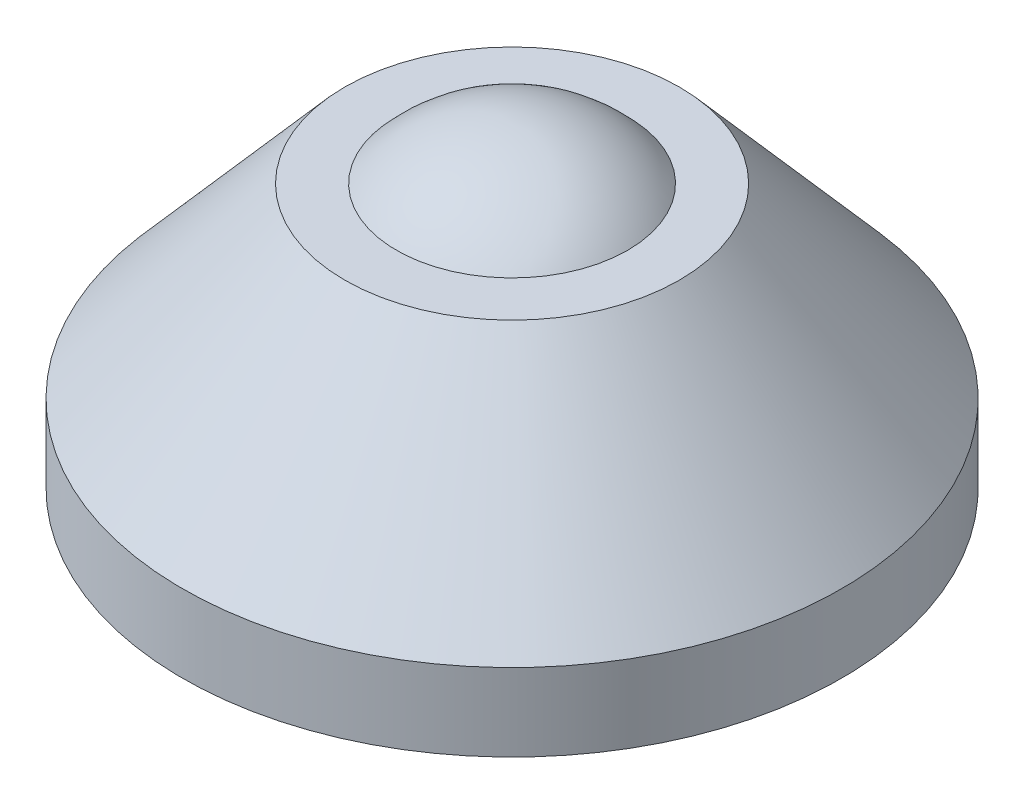
ISO-10303-21;
HEADER;
FILE_DESCRIPTION(('STEP AP214'),'2;1');
FILE_NAME('part.step','',(''),(''),'','','');
FILE_SCHEMA(('AUTOMOTIVE_DESIGN { 1 0 10303 214 1 1 1 1 }'));
ENDSEC;
DATA;
#1=APPLICATION_CONTEXT('core data for automotive mechanical design processes');
#2=APPLICATION_PROTOCOL_DEFINITION('international standard','automotive_design',2000,#1);
#3=PRODUCT_CONTEXT('',#1,'mechanical');
#4=PRODUCT('Part','Part','',(#3));
#5=PRODUCT_RELATED_PRODUCT_CATEGORY('part','',(#4));
#6=PRODUCT_DEFINITION_FORMATION('','',#4);
#7=PRODUCT_DEFINITION_CONTEXT('part definition',#1,'design');
#8=PRODUCT_DEFINITION('design','',#6,#7);
#9=PRODUCT_DEFINITION_SHAPE('','',#8);
#10=(LENGTH_UNIT() NAMED_UNIT(*) SI_UNIT(.MILLI.,.METRE.));
#11=(NAMED_UNIT(*) PLANE_ANGLE_UNIT() SI_UNIT($,.RADIAN.));
#12=(NAMED_UNIT(*) SI_UNIT($,.STERADIAN.) SOLID_ANGLE_UNIT());
#13=UNCERTAINTY_MEASURE_WITH_UNIT(LENGTH_MEASURE(1.E-05),#10,'distance_accuracy_value','');
#14=(GEOMETRIC_REPRESENTATION_CONTEXT(3) GLOBAL_UNCERTAINTY_ASSIGNED_CONTEXT((#13)) GLOBAL_UNIT_ASSIGNED_CONTEXT((#10,
#11,#12)) REPRESENTATION_CONTEXT('',''));
#15=CARTESIAN_POINT('',(0.,0.,0.));
#16=DIRECTION('',(0.,0.,1.));
#17=DIRECTION('',(1.,0.,0.));
#18=AXIS2_PLACEMENT_3D('',#15,#16,#17);
#19=CARTESIAN_POINT('',(0.,0.,0.));
#20=DIRECTION('',(0.,1.,0.));
#21=DIRECTION('',(1.,0.,0.));
#22=AXIS2_PLACEMENT_3D('',#19,#20,#21);
#23=SPHERICAL_SURFACE('',#22,6.);
#24=CARTESIAN_POINT('',(0.,4.,0.));
#25=DIRECTION('',(0.,1.,0.));
#26=DIRECTION('',(-1.,0.,0.));
#27=AXIS2_PLACEMENT_3D('',#24,#25,#26);
#28=CIRCLE('',#27,4.47213595499958);
#29=CARTESIAN_POINT('',(-4.47213595499958,4.,0.));
#30=VERTEX_POINT('',#29);
#31=EDGE_CURVE('E10',#30,#30,#28,.T.);
#32=ORIENTED_EDGE('',*,*,#31,.T.);
#33=EDGE_LOOP('',(#32));
#34=FACE_BOUND('',#33,.T.);
#35=ADVANCED_FACE('F30',(#34),#23,.T.);
#36=CARTESIAN_POINT('',(4.47213595499958,4.,0.));
#37=DIRECTION('',(0.,-1.,0.));
#38=DIRECTION('',(1.,0.,0.));
#39=AXIS2_PLACEMENT_3D('',#36,#37,#38);
#40=PLANE('',#39);
#41=ORIENTED_EDGE('',*,*,#31,.F.);
#42=EDGE_LOOP('',(#41));
#43=FACE_BOUND('',#42,.T.);
#44=CARTESIAN_POINT('',(0.,4.,0.));
#45=DIRECTION('',(0.,1.,0.));
#46=DIRECTION('',(-1.,0.,0.));
#47=AXIS2_PLACEMENT_3D('',#44,#45,#46);
#48=CIRCLE('',#47,6.47213595499958);
#49=CARTESIAN_POINT('',(-6.47213595499958,4.,0.));
#50=VERTEX_POINT('',#49);
#51=EDGE_CURVE('E36',#50,#50,#48,.T.);
#52=ORIENTED_EDGE('',*,*,#51,.T.);
#53=EDGE_LOOP('',(#52));
#54=FACE_BOUND('',#53,.T.);
#55=ADVANCED_FACE('F68',(#43,#54),#40,.F.);
#56=CARTESIAN_POINT('',(0.,-3.2,0.));
#57=DIRECTION('',(0.,-1.,0.));
#58=DIRECTION('',(1.,0.,0.));
#59=AXIS2_PLACEMENT_3D('',#56,#57,#58);
#60=CONICAL_SURFACE('',#59,12.75,0.717086069578653);
#61=ORIENTED_EDGE('',*,*,#51,.F.);
#62=EDGE_LOOP('',(#61));
#63=FACE_BOUND('',#62,.T.);
#64=CARTESIAN_POINT('',(0.,-3.2,0.));
#65=DIRECTION('',(0.,1.,0.));
#66=DIRECTION('',(-1.,0.,0.));
#67=AXIS2_PLACEMENT_3D('',#64,#65,#66);
#68=CIRCLE('',#67,12.75);
#69=CARTESIAN_POINT('',(-12.75,-3.2,0.));
#70=VERTEX_POINT('',#69);
#71=EDGE_CURVE('E40',#70,#70,#68,.T.);
#72=ORIENTED_EDGE('',*,*,#71,.T.);
#73=EDGE_LOOP('',(#72));
#74=FACE_BOUND('',#73,.T.);
#75=ADVANCED_FACE('F72',(#63,#74),#60,.T.);
#76=CARTESIAN_POINT('',(0.,6.,0.));
#77=DIRECTION('',(0.,1.,0.));
#78=DIRECTION('',(-1.,0.,0.));
#79=AXIS2_PLACEMENT_3D('',#76,#77,#78);
#80=CYLINDRICAL_SURFACE('',#79,12.75);
#81=ORIENTED_EDGE('',*,*,#71,.F.);
#82=EDGE_LOOP('',(#81));
#83=FACE_BOUND('',#82,.T.);
#84=CARTESIAN_POINT('',(0.,-6.2,0.));
#85=DIRECTION('',(0.,1.,0.));
#86=DIRECTION('',(-1.,0.,0.));
#87=AXIS2_PLACEMENT_3D('',#84,#85,#86);
#88=CIRCLE('',#87,12.75);
#89=CARTESIAN_POINT('',(-12.75,-6.2,0.));
#90=VERTEX_POINT('',#89);
#91=EDGE_CURVE('E44',#90,#90,#88,.T.);
#92=ORIENTED_EDGE('',*,*,#91,.T.);
#93=EDGE_LOOP('',(#92));
#94=FACE_BOUND('',#93,.T.);
#95=ADVANCED_FACE('F77',(#83,#94),#80,.T.);
#96=CARTESIAN_POINT('',(12.75,-6.2,0.));
#97=DIRECTION('',(0.,1.,0.));
#98=DIRECTION('',(-1.,0.,0.));
#99=AXIS2_PLACEMENT_3D('',#96,#97,#98);
#100=PLANE('',#99);
#101=ORIENTED_EDGE('',*,*,#91,.F.);
#102=EDGE_LOOP('',(#101));
#103=FACE_BOUND('',#102,.T.);
#104=CARTESIAN_POINT('',(0.,-6.2,0.));
#105=DIRECTION('',(0.,1.,0.));
#106=DIRECTION('',(-1.,0.,0.));
#107=AXIS2_PLACEMENT_3D('',#104,#105,#106);
#108=CIRCLE('',#107,1.5);
#109=CARTESIAN_POINT('',(-1.5,-6.2,0.));
#110=VERTEX_POINT('',#109);
#111=EDGE_CURVE('E49',#110,#110,#108,.T.);
#112=ORIENTED_EDGE('',*,*,#111,.T.);
#113=EDGE_LOOP('',(#112));
#114=FACE_BOUND('',#113,.T.);
#115=ADVANCED_FACE('F64',(#103,#114),#100,.F.);
#116=CARTESIAN_POINT('',(0.,6.,0.));
#117=DIRECTION('',(0.,1.,0.));
#118=DIRECTION('',(-1.,0.,0.));
#119=AXIS2_PLACEMENT_3D('',#116,#117,#118);
#120=CYLINDRICAL_SURFACE('',#119,1.5);
#121=ORIENTED_EDGE('',*,*,#111,.F.);
#122=EDGE_LOOP('',(#121));
#123=FACE_BOUND('',#122,.T.);
#124=CARTESIAN_POINT('',(0.,-10.7,0.));
#125=DIRECTION('',(0.,1.,0.));
#126=DIRECTION('',(-1.,0.,0.));
#127=AXIS2_PLACEMENT_3D('',#124,#125,#126);
#128=CIRCLE('',#127,1.5);
#129=CARTESIAN_POINT('',(-1.5,-10.7,0.));
#130=VERTEX_POINT('',#129);
#131=EDGE_CURVE('E52',#130,#130,#128,.T.);
#132=ORIENTED_EDGE('',*,*,#131,.T.);
#133=EDGE_LOOP('',(#132));
#134=FACE_BOUND('',#133,.T.);
#135=ADVANCED_FACE('F56',(#123,#134),#120,.T.);
#136=CARTESIAN_POINT('',(1.5,-10.7,0.));
#137=DIRECTION('',(0.,1.,0.));
#138=DIRECTION('',(-1.,0.,0.));
#139=AXIS2_PLACEMENT_3D('',#136,#137,#138);
#140=PLANE('',#139);
#141=ORIENTED_EDGE('',*,*,#131,.F.);
#142=EDGE_LOOP('',(#141));
#143=FACE_BOUND('',#142,.T.);
#144=ADVANCED_FACE('F58',(#143),#140,.F.);
#145=CLOSED_SHELL('',(#35,#55,#75,#95,#115,#135,#144));
#146=MANIFOLD_SOLID_BREP('B2',#145);
#147=ADVANCED_BREP_SHAPE_REPRESENTATION('',(#18,#146),#14);
#148=SHAPE_DEFINITION_REPRESENTATION(#9,#147);
ENDSEC;
END-ISO-10303-21;
